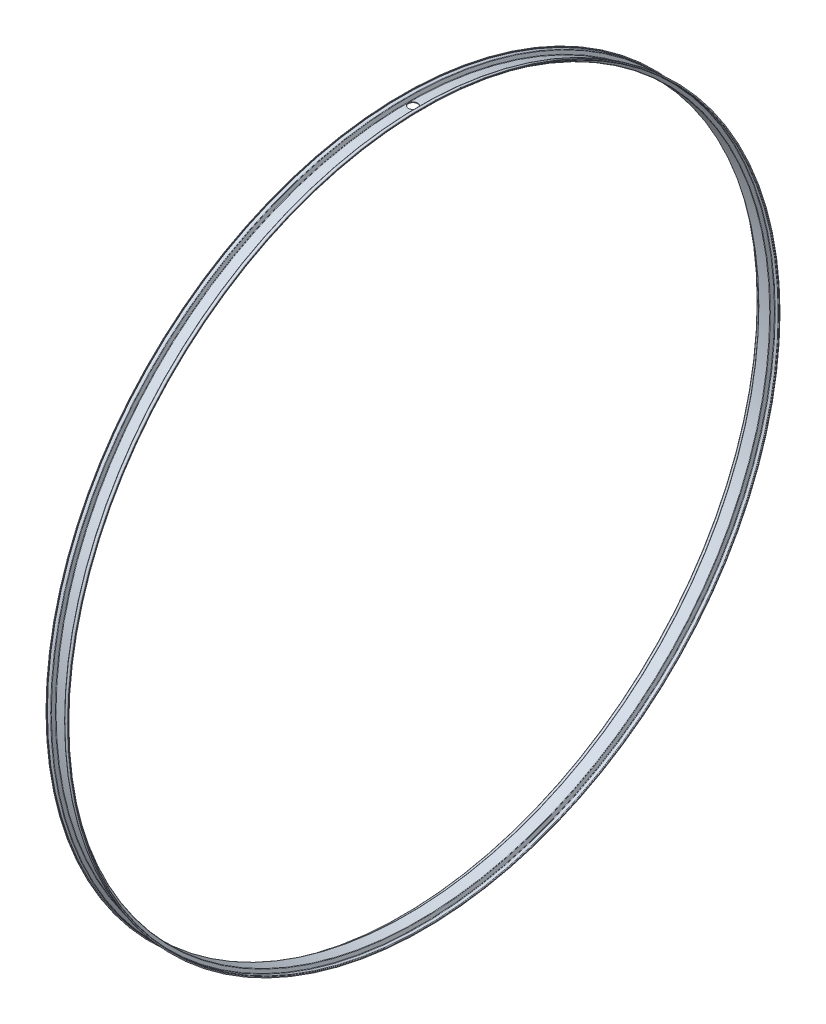
ISO-10303-21;
HEADER;
FILE_DESCRIPTION(('STEP AP214'),'2;1');
FILE_NAME('part.step','',(''),(''),'','','');
FILE_SCHEMA(('AUTOMOTIVE_DESIGN { 1 0 10303 214 1 1 1 1 }'));
ENDSEC;
DATA;
#1=APPLICATION_CONTEXT('core data for automotive mechanical design processes');
#2=APPLICATION_PROTOCOL_DEFINITION('international standard','automotive_design',2000,#1);
#3=PRODUCT_CONTEXT('',#1,'mechanical');
#4=PRODUCT('Part','Part','',(#3));
#5=PRODUCT_RELATED_PRODUCT_CATEGORY('part','',(#4));
#6=PRODUCT_DEFINITION_FORMATION('','',#4);
#7=PRODUCT_DEFINITION_CONTEXT('part definition',#1,'design');
#8=PRODUCT_DEFINITION('design','',#6,#7);
#9=PRODUCT_DEFINITION_SHAPE('','',#8);
#10=(LENGTH_UNIT() NAMED_UNIT(*) SI_UNIT(.MILLI.,.METRE.));
#11=(NAMED_UNIT(*) PLANE_ANGLE_UNIT() SI_UNIT($,.RADIAN.));
#12=(NAMED_UNIT(*) SI_UNIT($,.STERADIAN.) SOLID_ANGLE_UNIT());
#13=UNCERTAINTY_MEASURE_WITH_UNIT(LENGTH_MEASURE(1.E-05),#10,'distance_accuracy_value','');
#14=(GEOMETRIC_REPRESENTATION_CONTEXT(3) GLOBAL_UNCERTAINTY_ASSIGNED_CONTEXT((#13)) GLOBAL_UNIT_ASSIGNED_CONTEXT((#10,
#11,#12)) REPRESENTATION_CONTEXT('',''));
#15=CARTESIAN_POINT('',(0.,0.,0.));
#16=DIRECTION('',(0.,0.,1.));
#17=DIRECTION('',(1.,0.,0.));
#18=AXIS2_PLACEMENT_3D('',#15,#16,#17);
#19=CARTESIAN_POINT('',(-11.2328924162257,0.,0.));
#20=DIRECTION('',(-1.,0.,0.));
#21=DIRECTION('',(0.,0.,1.));
#22=AXIS2_PLACEMENT_3D('',#19,#20,#21);
#23=CYLINDRICAL_SURFACE('',#22,306.5);
#24=CARTESIAN_POINT('',(-4.66666666666666,0.,0.));
#25=DIRECTION('',(1.,0.,0.));
#26=DIRECTION('',(0.,0.,-1.));
#27=AXIS2_PLACEMENT_3D('',#24,#25,#26);
#28=CIRCLE('',#27,306.5);
#29=CARTESIAN_POINT('',(-4.66666666666666,0.,-306.5));
#30=VERTEX_POINT('',#29);
#31=EDGE_CURVE('E81',#30,#30,#28,.F.);
#32=ORIENTED_EDGE('',*,*,#31,.T.);
#33=EDGE_LOOP('',(#32));
#34=FACE_BOUND('',#33,.T.);
#35=CARTESIAN_POINT('',(4.66666666666666,0.,0.));
#36=DIRECTION('',(1.,0.,0.));
#37=DIRECTION('',(0.,0.,-1.));
#38=AXIS2_PLACEMENT_3D('',#35,#36,#37);
#39=CIRCLE('',#38,306.5);
#40=CARTESIAN_POINT('',(4.66666666666666,0.,-306.5));
#41=VERTEX_POINT('',#40);
#42=EDGE_CURVE('E78',#41,#41,#39,.T.);
#43=ORIENTED_EDGE('',*,*,#42,.T.);
#44=EDGE_LOOP('',(#43));
#45=FACE_BOUND('',#44,.T.);
#46=CARTESIAN_POINT('',(0.,306.473897746611,-4.00000000000001));
#47=CARTESIAN_POINT('',(0.224671491113787,306.473898099484,-3.99999004008703));
#48=CARTESIAN_POINT('',(0.449505646728402,306.474147454764,-3.98100750107468));
#49=CARTESIAN_POINT('',(0.892981203904015,306.475118203566,-3.90554619872519));
#50=CARTESIAN_POINT('',(1.11161483252134,306.475840164426,-3.84902236781322));
#51=CARTESIAN_POINT('',(1.53620035744824,306.477674325274,-3.70008849065035));
#52=CARTESIAN_POINT('',(1.74215828399459,306.478786337989,-3.60769566372456));
#53=CARTESIAN_POINT('',(2.13558191154165,306.481275060028,-3.38967033891498));
#54=CARTESIAN_POINT('',(2.32305217909934,306.482651703738,-3.26404607775796));
#55=CARTESIAN_POINT('',(2.67427542582028,306.485514911113,-2.98309061111759));
#56=CARTESIAN_POINT('',(2.83802465670473,306.487001492093,-2.82775471973071));
#57=CARTESIAN_POINT('',(3.13712709999816,306.489916865002,-2.49179051313609));
#58=CARTESIAN_POINT('',(3.27247919430501,306.491345654653,-2.311161202498));
#59=CARTESIAN_POINT('',(3.51093978329407,306.493984327251,-1.92973810948226));
#60=CARTESIAN_POINT('',(3.61404772876004,306.495194206469,-1.72894398371325));
#61=CARTESIAN_POINT('',(3.78508887690038,306.497258620251,-1.31289386383484));
#62=CARTESIAN_POINT('',(3.8530221635972,306.498113155664,-1.09763790427211));
#63=CARTESIAN_POINT('',(3.95178222468829,306.499370502746,-0.658787004672028));
#64=CARTESIAN_POINT('',(3.9826110711892,306.499773339639,-0.43519253102009));
#65=CARTESIAN_POINT('',(4.00629345607914,306.500081958505,0.013998449637373));
#66=CARTESIAN_POINT('',(3.9991470786256,306.499987741578,0.239594952205067));
#67=CARTESIAN_POINT('',(3.94708380428691,306.499312898516,0.686371977888896));
#68=CARTESIAN_POINT('',(3.90216919535925,306.498732301845,0.907552767673113));
#69=CARTESIAN_POINT('',(3.77584792945238,306.497150185938,1.33923450109525));
#70=CARTESIAN_POINT('',(3.69444122602987,306.496148666166,1.54973543114058));
#71=CARTESIAN_POINT('',(3.49744403063779,306.493837559996,1.95408911569046));
#72=CARTESIAN_POINT('',(3.38185249107094,306.492527964158,2.1479413597596));
#73=CARTESIAN_POINT('',(3.11976773545229,306.489748342096,2.5134891535125));
#74=CARTESIAN_POINT('',(2.97327451617181,306.488278315856,2.68518470088125));
#75=CARTESIAN_POINT('',(2.65353182924212,306.48534342464,3.00155868628569));
#76=CARTESIAN_POINT('',(2.48028036389358,306.483878560058,3.1462351053622));
#77=CARTESIAN_POINT('',(2.11194630000829,306.481119254487,3.4044483908349));
#78=CARTESIAN_POINT('',(1.91686369850563,306.479824813521,3.51798525300055));
#79=CARTESIAN_POINT('',(1.51040408351148,306.477552305354,3.71069620009634));
#80=CARTESIAN_POINT('',(1.29902704183232,306.476574238701,3.78987022558079));
#81=CARTESIAN_POINT('',(0.865979391617674,306.475044776151,3.91160671998754));
#82=CARTESIAN_POINT('',(0.644308788760933,306.474493380019,3.95416920910739));
#83=CARTESIAN_POINT('',(0.196984086633276,306.473879465282,4.001471952866));
#84=CARTESIAN_POINT('',(-0.0286697174887044,306.473816910606,4.00621499817331));
#85=CARTESIAN_POINT('',(-0.477570599960375,306.474187637362,3.9777514810267));
#86=CARTESIAN_POINT('',(-0.700817678749348,306.474620918705,3.94454492549959));
#87=CARTESIAN_POINT('',(-1.13856004689291,306.475934436635,3.84112714455738));
#88=CARTESIAN_POINT('',(-1.35305563463638,306.476814657971,3.77091718194009));
#89=CARTESIAN_POINT('',(-1.76721527682583,306.47892280651,3.5954869231225));
#90=CARTESIAN_POINT('',(-1.96687932718051,306.48015073381,3.49026661726462));
#91=CARTESIAN_POINT('',(-2.34572091198916,306.48281594592,3.24779535761251));
#92=CARTESIAN_POINT('',(-2.52489724413876,306.484253243006,3.11054252545252));
#93=CARTESIAN_POINT('',(-2.85766511754281,306.487175110404,2.80790511076166));
#94=CARTESIAN_POINT('',(-3.01125663806009,306.488659680754,2.64252050542947));
#95=CARTESIAN_POINT('',(-3.28850414599514,306.491508828741,2.28830235326852));
#96=CARTESIAN_POINT('',(-3.41215832759051,306.492873399135,2.09946739295163));
#97=CARTESIAN_POINT('',(-3.62600856025281,306.495328602469,1.70371638631362));
#98=CARTESIAN_POINT('',(-3.71620465424668,306.49641923576,1.49680036319104));
#99=CARTESIAN_POINT('',(-3.8605752908649,306.49820357454,1.07076768136215));
#100=CARTESIAN_POINT('',(-3.91475101566438,306.498897293055,0.851651423318843));
#101=CARTESIAN_POINT('',(-3.98554696940472,306.49980964543,0.40743227013172));
#102=CARTESIAN_POINT('',(-4.00216714969382,306.500028278673,0.182329367232824));
#103=CARTESIAN_POINT('',(-3.99737994522976,306.499965810826,-0.267454430431673));
#104=CARTESIAN_POINT('',(-3.97597545497528,306.499684747773,-0.492135356015586));
#105=CARTESIAN_POINT('',(-3.89575235748228,306.498654645373,-0.93471475755001));
#106=CARTESIAN_POINT('',(-3.83693367518455,306.497905605088,-1.15261321989283));
#107=CARTESIAN_POINT('',(-3.68355115042983,306.496023966824,-1.57544616137659));
#108=CARTESIAN_POINT('',(-3.58898664864653,306.494891361772,-1.78038040131298));
#109=CARTESIAN_POINT('',(-3.36680110670951,306.492370319351,-2.17145672875409));
#110=CARTESIAN_POINT('',(-3.23918134509481,306.490981891878,-2.35759954270238));
#111=CARTESIAN_POINT('',(-2.9545119739493,306.488105709753,-2.70581462853707));
#112=CARTESIAN_POINT('',(-2.79746325704137,306.486617958114,-2.86788763022857));
#113=CARTESIAN_POINT('',(-2.4583395638197,306.48371041295,-3.16340880646173));
#114=CARTESIAN_POINT('',(-2.27625838140577,306.482290636395,-3.29684986143866));
#115=CARTESIAN_POINT('',(-1.89219926591783,306.479678852065,-3.53132419016103));
#116=CARTESIAN_POINT('',(-1.69021124005617,306.478486960737,-3.63234091311074));
#117=CARTESIAN_POINT('',(-1.27229914448089,306.476467720134,-3.79891284555364));
#118=CARTESIAN_POINT('',(-1.05639211386792,306.475639934498,-3.86451052441714));
#119=CARTESIAN_POINT('',(-0.699259477652309,306.474664476077,-3.94091781558989));
#120=CARTESIAN_POINT('',(-0.560353981378442,306.474378193147,-3.96304594097856));
#121=CARTESIAN_POINT('',(-0.28098686881276,306.473994718063,-3.99259014759408));
#122=CARTESIAN_POINT('',(-0.140525252606067,306.473897525899,-4.00000622962568));
#123=CARTESIAN_POINT('',(0.,306.473897746611,-4.00000000000001));
#124=B_SPLINE_CURVE_WITH_KNOTS('',3,(#46,#47,#48,#49,#50,#51,#52,#53,#54,#55,#56,#57,#58,#59,
#60,#61,#62,#63,#64,#65,#66,#67,#68,#69,#70,#71,#72,#73,#74,#75,#76,#77,#78,#79,#80,#81,#82,#83,
#84,#85,#86,#87,#88,#89,#90,#91,#92,#93,#94,#95,#96,#97,#98,#99,#100,#101,#102,#103,#104,#105,
#106,#107,#108,#109,#110,#111,#112,#113,#114,#115,#116,#117,#118,#119,#120,#121,#122,#123),
.UNSPECIFIED.,.T.,.F.,(4,2,2,2,2,2,2,2,2,2,2,2,2,2,2,2,2,2,2,2,2,2,2,2,2,2,2,2,2,2,2,2,2,2,2,2,
2,2,4),(0.,0.673501553031845,1.34781309623774,2.02180132790529,2.69562266145693,
3.36955035299317,4.04350457462082,4.71747027511994,5.39143436569563,6.06536081683324,
6.73928577447353,7.41316990942957,8.08705490203669,8.76096054804817,9.43486626447107,
10.1088223172408,10.7827784615727,11.4567357718046,12.1306927102332,12.8045999174219,
13.4785070016048,14.1523910891679,14.8262753626219,15.5001991621289,16.1741235078664,
16.8480884946453,17.5220526167198,18.1959946184501,18.8699374932457,19.5438290686308,
20.217721995961,20.8916273537521,21.5655066495591,22.2393655089377,22.913391735076,
23.5877614685243,24.2613207899182,24.6825757545701,25.1038306961792),.UNSPECIFIED.);
#125=CARTESIAN_POINT('',(0.,306.473897746611,-4.00000000000001));
#126=VERTEX_POINT('',#125);
#127=EDGE_CURVE('E117',#126,#126,#124,.T.);
#128=ORIENTED_EDGE('',*,*,#127,.F.);
#129=EDGE_LOOP('',(#128));
#130=FACE_BOUND('',#129,.T.);
#131=ADVANCED_FACE('F27',(#34,#45,#130),#23,.F.);
#132=CARTESIAN_POINT('',(-11.2328924162257,0.,0.));
#133=DIRECTION('',(-1.,0.,0.));
#134=DIRECTION('',(0.,0.,1.));
#135=AXIS2_PLACEMENT_3D('',#132,#133,#134);
#136=CYLINDRICAL_SURFACE('',#135,307.);
#137=CARTESIAN_POINT('',(-4.33333333333332,0.,0.));
#138=DIRECTION('',(-1.,0.,0.));
#139=DIRECTION('',(0.,0.,1.));
#140=AXIS2_PLACEMENT_3D('',#137,#138,#139);
#141=CIRCLE('',#140,307.);
#142=CARTESIAN_POINT('',(-4.33333333333332,0.,307.));
#143=VERTEX_POINT('',#142);
#144=EDGE_CURVE('E39',#143,#143,#141,.F.);
#145=ORIENTED_EDGE('',*,*,#144,.T.);
#146=EDGE_LOOP('',(#145));
#147=FACE_BOUND('',#146,.T.);
#148=CARTESIAN_POINT('',(4.33333333333332,0.,0.));
#149=DIRECTION('',(-1.,0.,0.));
#150=DIRECTION('',(0.,0.,1.));
#151=AXIS2_PLACEMENT_3D('',#148,#149,#150);
#152=CIRCLE('',#151,307.);
#153=CARTESIAN_POINT('',(4.33333333333332,0.,307.));
#154=VERTEX_POINT('',#153);
#155=EDGE_CURVE('E10',#154,#154,#152,.T.);
#156=ORIENTED_EDGE('',*,*,#155,.T.);
#157=EDGE_LOOP('',(#156));
#158=FACE_BOUND('',#157,.T.);
#159=CARTESIAN_POINT('',(0.,306.973940262036,-4.00000000000006));
#160=CARTESIAN_POINT('',(-0.224671524523298,306.973940614335,-3.99999004007576));
#161=CARTESIAN_POINT('',(-0.449505714364031,306.974189563503,-3.98100749543986));
#162=CARTESIAN_POINT('',(-0.892981341340778,306.975158731319,-3.9055461694517));
#163=CARTESIAN_POINT('',(-1.11161500549672,306.975879516384,-3.84902232029855));
#164=CARTESIAN_POINT('',(-1.53620060168189,306.977710690143,-3.70008839183099));
#165=CARTESIAN_POINT('',(-1.74215856385908,306.978820891872,-3.60769553159317));
#166=CARTESIAN_POINT('',(-2.13558225559796,306.981305560897,-3.38967012528727));
#167=CARTESIAN_POINT('',(-2.32305255176983,306.982679962685,-3.26404581604283));
#168=CARTESIAN_POINT('',(-2.67427581239524,306.985538506937,-2.98309026548255));
#169=CARTESIAN_POINT('',(-2.83802503268025,306.987022666669,-2.82775434340226));
#170=CARTESIAN_POINT('',(-3.13712744710857,306.989933291128,-2.49179007726189));
#171=CARTESIAN_POINT('',(-3.27247952315907,306.991359753581,-2.31116073778007));
#172=CARTESIAN_POINT('',(-3.51094005356269,306.993994128052,-1.92973761588895));
#173=CARTESIAN_POINT('',(-3.61404796244238,306.995202036372,-1.72894349242863));
#174=CARTESIAN_POINT('',(-3.78508904020217,306.997263087096,-1.31289338947289));
#175=CARTESIAN_POINT('',(-3.85302229306144,306.998116230347,-1.09763744450633));
#176=CARTESIAN_POINT('',(-3.95178230257386,306.999371528991,-0.658786543063262));
#177=CARTESIAN_POINT('',(-3.98261112436006,306.999773709484,-0.435192051402092));
#178=CARTESIAN_POINT('',(-4.00629345509424,307.00008182501,0.0139989598463144));
#179=CARTESIAN_POINT('',(-3.99914704814848,306.999987761143,0.239595474998432));
#180=CARTESIAN_POINT('',(-3.94708370517001,306.999314016298,0.686372567212298));
#181=CARTESIAN_POINT('',(-3.90216904960303,306.998734364641,0.907553410069089));
#182=CARTESIAN_POINT('',(-3.77584767048059,306.997154824171,1.33923524178861));
#183=CARTESIAN_POINT('',(-3.69444090050756,306.996154934825,1.54973621706628));
#184=CARTESIAN_POINT('',(-3.4974435626224,306.993847591384,1.95408995856477));
#185=CARTESIAN_POINT('',(-3.38185195055622,306.992540127895,2.14794221602776));
#186=CARTESIAN_POINT('',(-3.11976704012206,306.989765032055,2.51349002096246));
#187=CARTESIAN_POINT('',(-2.97327373857661,306.988297399687,2.68518556615589));
#188=CARTESIAN_POINT('',(-2.65353092204143,306.985367288545,3.00155948804889));
#189=CARTESIAN_POINT('',(-2.48027941584223,306.983904810162,3.14623585234699));
#190=CARTESIAN_POINT('',(-2.11194528348035,306.981149999752,3.40444902107899));
#191=CARTESIAN_POINT('',(-1.91686265435214,306.979857667749,3.51798582128289));
#192=CARTESIAN_POINT('',(-1.51040300181046,306.977588862447,3.71069663972548));
#193=CARTESIAN_POINT('',(-1.29902595030502,306.976612389693,3.78987059872022));
#194=CARTESIAN_POINT('',(-0.865978296875617,306.975085420046,3.91160696144251));
#195=CARTESIAN_POINT('',(-0.644307700613396,306.974534922919,3.9541693853072));
#196=CARTESIAN_POINT('',(-0.196982970959951,306.973922009741,4.00147200971533));
#197=CARTESIAN_POINT('',(0.0286708682438425,306.973859557794,4.0062149918448));
#198=CARTESIAN_POINT('',(0.477571810429255,306.974229682434,3.97775133763645));
#199=CARTESIAN_POINT('',(0.700818913848376,306.974662258932,3.94454470819732));
#200=CARTESIAN_POINT('',(1.13856134529725,306.975973639217,3.84112676331502));
#201=CARTESIAN_POINT('',(1.35305697074308,306.976852427827,3.77091670655149));
#202=CARTESIAN_POINT('',(1.76721667137197,306.978957144545,3.59548624185708));
#203=CARTESIAN_POINT('',(1.96688074248337,306.980183072747,3.4902658243149));
#204=CARTESIAN_POINT('',(2.34572230931802,306.982843945229,3.24779435037668));
#205=CARTESIAN_POINT('',(2.52489860665704,306.984278901724,3.11054142174061));
#206=CARTESIAN_POINT('',(2.85766639126619,306.987196010588,2.80790381692908));
#207=CARTESIAN_POINT('',(3.01125785783293,306.988678162995,2.64251911798946));
#208=CARTESIAN_POINT('',(3.28850520989275,306.991522669819,2.28830082302399));
#209=CARTESIAN_POINT('',(3.41215929541036,306.99288501703,2.09946581808818));
#210=CARTESIAN_POINT('',(3.62600933051267,306.995336219847,1.70371474468728));
#211=CARTESIAN_POINT('',(3.7162053229996,306.996425075805,1.49679869940732));
#212=CARTESIAN_POINT('',(3.86057576442476,306.998206506303,1.07076597422887));
#213=CARTESIAN_POINT('',(3.91475139173827,306.998899093807,0.851649693704759));
#214=CARTESIAN_POINT('',(3.98554714865052,306.999809957791,0.407430515309249));
#215=CARTESIAN_POINT('',(4.0021672295356,307.000028233656,0.182327609672926));
#216=CARTESIAN_POINT('',(3.9973798275177,306.999965864974,-0.267456231610213));
#217=CARTESIAN_POINT('',(3.97597522992876,306.999685258283,-0.492137197978779));
#218=CARTESIAN_POINT('',(3.89575190313022,306.998656830733,-0.934716663726365));
#219=CARTESIAN_POINT('',(3.83693309886077,306.997909008937,-1.15261514949755));
#220=CARTESIAN_POINT('',(3.68355031695002,306.996030432495,-1.57544811819663));
#221=CARTESIAN_POINT('',(3.58898567995627,306.994899670784,-1.78038236191022));
#222=CARTESIAN_POINT('',(3.36679985754237,306.992382732091,-2.17145867189447));
#223=CARTESIAN_POINT('',(3.23917995072487,306.99099656499,-2.35760146464559));
#224=CARTESIAN_POINT('',(2.95451031984494,306.988125066329,-2.70581643556063));
#225=CARTESIAN_POINT('',(2.79746149552175,306.986639737802,-2.86788934934882));
#226=CARTESIAN_POINT('',(2.45833760356065,306.983736928865,-3.1634103305783));
#227=CARTESIAN_POINT('',(2.27625632981208,306.982319465399,-3.29685127843344));
#228=CARTESIAN_POINT('',(1.89219707460493,306.979711937032,-3.53132536336945));
#229=CARTESIAN_POINT('',(1.6902090024449,306.978521988367,-3.63234195304775));
#230=CARTESIAN_POINT('',(1.27229684422677,306.976506039698,-3.79891361466021));
#231=CARTESIAN_POINT('',(1.05638979729004,306.975679604043,-3.86451115610832));
#232=CARTESIAN_POINT('',(0.699257527298371,306.97470573827,-3.94091814758694));
#233=CARTESIAN_POINT('',(0.560352412695073,306.974419923267,-3.96304614877196));
#234=CARTESIAN_POINT('',(0.280986077451796,306.974037074979,-3.9925901893846));
#235=CARTESIAN_POINT('',(0.140524856896659,306.973940041684,-4.00000622961434));
#236=CARTESIAN_POINT('',(0.,306.973940262036,-4.00000000000006));
#237=B_SPLINE_CURVE_WITH_KNOTS('',3,(#159,#160,#161,#162,#163,#164,#165,#166,#167,#168,#169,
#170,#171,#172,#173,#174,#175,#176,#177,#178,#179,#180,#181,#182,#183,#184,#185,#186,#187,#188,
#189,#190,#191,#192,#193,#194,#195,#196,#197,#198,#199,#200,#201,#202,#203,#204,#205,#206,#207,
#208,#209,#210,#211,#212,#213,#214,#215,#216,#217,#218,#219,#220,#221,#222,#223,#224,#225,#226,
#227,#228,#229,#230,#231,#232,#233,#234,#235,#236),.UNSPECIFIED.,.T.,.F.,(4,2,2,2,2,2,2,2,2,2,2,
2,2,2,2,2,2,2,2,2,2,2,2,2,2,2,2,2,2,2,2,2,2,2,2,2,2,2,4),(0.,0.673501654716201,1.34781330352654,
2.02180164554422,2.69562308753221,3.36955077084389,4.0435049840187,4.71747059783636,
5.39143460255975,6.06536109452025,6.73928609389159,7.41317040425624,8.08705557179668,
8.76096132485307,9.43486714720398,10.1088231423819,10.7827792291099,11.4567364777804,
12.1306933557594,12.804600664357,13.478507850448,14.1523921149187,14.826276564389,
15.5002004110064,16.174124802964,16.8480897043535,17.5220537415369,18.1959957294815,
18.8699385916024,19.5438303170976,20.217723394549,20.8916289029528,21.5655083480778,
22.2393671938419,22.9133934067534,23.5877630563801,24.261322291405,24.6825760707149,
25.1038298270575),.UNSPECIFIED.);
#238=CARTESIAN_POINT('',(0.,306.973940262036,-4.00000000000006));
#239=VERTEX_POINT('',#238);
#240=EDGE_CURVE('E31',#239,#239,#237,.T.);
#241=ORIENTED_EDGE('',*,*,#240,.F.);
#242=EDGE_LOOP('',(#241));
#243=FACE_BOUND('',#242,.T.);
#244=ADVANCED_FACE('F187',(#147,#158,#243),#136,.T.);
#245=CARTESIAN_POINT('',(-9.5,309.5,0.));
#246=DIRECTION('',(1.,0.,0.));
#247=DIRECTION('',(0.,0.,-1.));
#248=AXIS2_PLACEMENT_3D('',#245,#246,#247);
#249=PLANE('',#248);
#250=CARTESIAN_POINT('',(-9.5,0.,0.));
#251=DIRECTION('',(1.,0.,0.));
#252=DIRECTION('',(0.,0.,-1.));
#253=AXIS2_PLACEMENT_3D('',#250,#251,#252);
#254=CIRCLE('',#253,310.);
#255=CARTESIAN_POINT('',(-9.5,0.,-310.));
#256=VERTEX_POINT('',#255);
#257=EDGE_CURVE('E54',#256,#256,#254,.T.);
#258=ORIENTED_EDGE('',*,*,#257,.T.);
#259=EDGE_LOOP('',(#258));
#260=FACE_BOUND('',#259,.T.);
#261=CARTESIAN_POINT('',(-9.5,0.,0.));
#262=DIRECTION('',(-1.,0.,0.));
#263=DIRECTION('',(0.,0.,1.));
#264=AXIS2_PLACEMENT_3D('',#261,#262,#263);
#265=CIRCLE('',#264,310.7);
#266=CARTESIAN_POINT('',(-9.5,0.,310.7));
#267=VERTEX_POINT('',#266);
#268=EDGE_CURVE('E114',#267,#267,#265,.T.);
#269=ORIENTED_EDGE('',*,*,#268,.T.);
#270=EDGE_LOOP('',(#269));
#271=FACE_BOUND('',#270,.T.);
#272=ADVANCED_FACE('F29',(#260,#271),#249,.F.);
#273=CARTESIAN_POINT('',(-11.2328924162257,0.,0.));
#274=DIRECTION('',(-1.,0.,0.));
#275=DIRECTION('',(0.,0.,1.));
#276=AXIS2_PLACEMENT_3D('',#273,#274,#275);
#277=CYLINDRICAL_SURFACE('',#276,309.5);
#278=CARTESIAN_POINT('',(-6.58333333333334,0.,0.));
#279=DIRECTION('',(-1.,0.,0.));
#280=DIRECTION('',(0.,0.,1.));
#281=AXIS2_PLACEMENT_3D('',#278,#279,#280);
#282=CIRCLE('',#281,309.5);
#283=CARTESIAN_POINT('',(-6.58333333333334,0.,309.5));
#284=VERTEX_POINT('',#283);
#285=EDGE_CURVE('E60',#284,#284,#282,.F.);
#286=ORIENTED_EDGE('',*,*,#285,.T.);
#287=EDGE_LOOP('',(#286));
#288=FACE_BOUND('',#287,.T.);
#289=CARTESIAN_POINT('',(-9.,0.,0.));
#290=DIRECTION('',(1.,0.,0.));
#291=DIRECTION('',(0.,0.,-1.));
#292=AXIS2_PLACEMENT_3D('',#289,#290,#291);
#293=CIRCLE('',#292,309.5);
#294=CARTESIAN_POINT('',(-9.,0.,-309.5));
#295=VERTEX_POINT('',#294);
#296=EDGE_CURVE('E63',#295,#295,#293,.F.);
#297=ORIENTED_EDGE('',*,*,#296,.T.);
#298=EDGE_LOOP('',(#297));
#299=FACE_BOUND('',#298,.T.);
#300=ADVANCED_FACE('F221',(#288,#299),#277,.F.);
#301=CARTESIAN_POINT('',(-6.25,0.,0.));
#302=DIRECTION('',(-1.,0.,0.));
#303=DIRECTION('',(0.,0.,1.));
#304=AXIS2_PLACEMENT_3D('',#301,#302,#303);
#305=CONICAL_SURFACE('',#304,309.5,1.17600520709514);
#306=CARTESIAN_POINT('',(-6.12179487179487,0.,0.));
#307=DIRECTION('',(-1.,0.,0.));
#308=DIRECTION('',(0.,0.,1.));
#309=AXIS2_PLACEMENT_3D('',#306,#307,#308);
#310=CIRCLE('',#309,309.192307692308);
#311=CARTESIAN_POINT('',(-6.12179487179487,0.,309.192307692308));
#312=VERTEX_POINT('',#311);
#313=EDGE_CURVE('E66',#312,#312,#310,.T.);
#314=ORIENTED_EDGE('',*,*,#313,.T.);
#315=EDGE_LOOP('',(#314));
#316=FACE_BOUND('',#315,.T.);
#317=CARTESIAN_POINT('',(-5.12820512820514,0.,0.));
#318=DIRECTION('',(1.,0.,0.));
#319=DIRECTION('',(0.,0.,-1.));
#320=AXIS2_PLACEMENT_3D('',#317,#318,#319);
#321=CIRCLE('',#320,306.807692307692);
#322=CARTESIAN_POINT('',(-5.12820512820514,0.,-306.807692307692));
#323=VERTEX_POINT('',#322);
#324=EDGE_CURVE('E69',#323,#323,#321,.T.);
#325=ORIENTED_EDGE('',*,*,#324,.T.);
#326=EDGE_LOOP('',(#325));
#327=FACE_BOUND('',#326,.T.);
#328=ADVANCED_FACE('F216',(#316,#327),#305,.F.);
#329=CARTESIAN_POINT('',(5.,0.,0.));
#330=DIRECTION('',(1.,0.,0.));
#331=DIRECTION('',(0.,0.,-1.));
#332=AXIS2_PLACEMENT_3D('',#329,#330,#331);
#333=CONICAL_SURFACE('',#332,306.5,1.17600520709514);
#334=CARTESIAN_POINT('',(5.12820512820514,0.,0.));
#335=DIRECTION('',(-1.,0.,0.));
#336=DIRECTION('',(0.,0.,1.));
#337=AXIS2_PLACEMENT_3D('',#334,#335,#336);
#338=CIRCLE('',#337,306.807692307692);
#339=CARTESIAN_POINT('',(5.12820512820514,0.,306.807692307692));
#340=VERTEX_POINT('',#339);
#341=EDGE_CURVE('E84',#340,#340,#338,.T.);
#342=ORIENTED_EDGE('',*,*,#341,.T.);
#343=EDGE_LOOP('',(#342));
#344=FACE_BOUND('',#343,.T.);
#345=CARTESIAN_POINT('',(6.12179487179487,0.,0.));
#346=DIRECTION('',(1.,0.,0.));
#347=DIRECTION('',(0.,0.,-1.));
#348=AXIS2_PLACEMENT_3D('',#345,#346,#347);
#349=CIRCLE('',#348,309.192307692308);
#350=CARTESIAN_POINT('',(6.12179487179487,0.,-309.192307692308));
#351=VERTEX_POINT('',#350);
#352=EDGE_CURVE('E87',#351,#351,#349,.T.);
#353=ORIENTED_EDGE('',*,*,#352,.T.);
#354=EDGE_LOOP('',(#353));
#355=FACE_BOUND('',#354,.T.);
#356=ADVANCED_FACE('F213',(#344,#355),#333,.F.);
#357=CARTESIAN_POINT('',(-11.2328924162257,0.,0.));
#358=DIRECTION('',(-1.,0.,0.));
#359=DIRECTION('',(0.,0.,1.));
#360=AXIS2_PLACEMENT_3D('',#357,#358,#359);
#361=CYLINDRICAL_SURFACE('',#360,309.5);
#362=CARTESIAN_POINT('',(6.58333333333334,0.,0.));
#363=DIRECTION('',(-1.,0.,0.));
#364=DIRECTION('',(0.,0.,1.));
#365=AXIS2_PLACEMENT_3D('',#362,#363,#364);
#366=CIRCLE('',#365,309.5);
#367=CARTESIAN_POINT('',(6.58333333333334,0.,309.5));
#368=VERTEX_POINT('',#367);
#369=EDGE_CURVE('E72',#368,#368,#366,.T.);
#370=ORIENTED_EDGE('',*,*,#369,.T.);
#371=EDGE_LOOP('',(#370));
#372=FACE_BOUND('',#371,.T.);
#373=CARTESIAN_POINT('',(9.,0.,0.));
#374=DIRECTION('',(-1.,0.,0.));
#375=DIRECTION('',(0.,0.,1.));
#376=AXIS2_PLACEMENT_3D('',#373,#374,#375);
#377=CIRCLE('',#376,309.5);
#378=CARTESIAN_POINT('',(9.,0.,309.5));
#379=VERTEX_POINT('',#378);
#380=EDGE_CURVE('E75',#379,#379,#377,.F.);
#381=ORIENTED_EDGE('',*,*,#380,.T.);
#382=EDGE_LOOP('',(#381));
#383=FACE_BOUND('',#382,.T.);
#384=ADVANCED_FACE('F210',(#372,#383),#361,.F.);
#385=CARTESIAN_POINT('',(9.5,309.5,0.));
#386=DIRECTION('',(-1.,0.,0.));
#387=DIRECTION('',(0.,0.,1.));
#388=AXIS2_PLACEMENT_3D('',#385,#386,#387);
#389=PLANE('',#388);
#390=CARTESIAN_POINT('',(9.5,0.,0.));
#391=DIRECTION('',(-1.,0.,0.));
#392=DIRECTION('',(0.,0.,1.));
#393=AXIS2_PLACEMENT_3D('',#390,#391,#392);
#394=CIRCLE('',#393,310.);
#395=CARTESIAN_POINT('',(9.5,0.,310.));
#396=VERTEX_POINT('',#395);
#397=EDGE_CURVE('E57',#396,#396,#394,.T.);
#398=ORIENTED_EDGE('',*,*,#397,.T.);
#399=EDGE_LOOP('',(#398));
#400=FACE_BOUND('',#399,.T.);
#401=CARTESIAN_POINT('',(9.5,0.,0.));
#402=DIRECTION('',(-1.,0.,0.));
#403=DIRECTION('',(0.,0.,1.));
#404=AXIS2_PLACEMENT_3D('',#401,#402,#403);
#405=CIRCLE('',#404,310.7);
#406=CARTESIAN_POINT('',(9.5,0.,310.7));
#407=VERTEX_POINT('',#406);
#408=EDGE_CURVE('E99',#407,#407,#405,.T.);
#409=ORIENTED_EDGE('',*,*,#408,.F.);
#410=EDGE_LOOP('',(#409));
#411=FACE_BOUND('',#410,.T.);
#412=ADVANCED_FACE('F206',(#400,#411),#389,.F.);
#413=CARTESIAN_POINT('',(-11.2328924162257,0.,0.));
#414=DIRECTION('',(-1.,0.,0.));
#415=DIRECTION('',(0.,0.,1.));
#416=AXIS2_PLACEMENT_3D('',#413,#414,#415);
#417=CYLINDRICAL_SURFACE('',#416,310.7);
#418=CARTESIAN_POINT('',(9.,0.,0.));
#419=DIRECTION('',(-1.,0.,0.));
#420=DIRECTION('',(0.,0.,1.));
#421=AXIS2_PLACEMENT_3D('',#418,#419,#420);
#422=CIRCLE('',#421,310.7);
#423=CARTESIAN_POINT('',(9.,0.,310.7));
#424=VERTEX_POINT('',#423);
#425=EDGE_CURVE('E102',#424,#424,#422,.T.);
#426=ORIENTED_EDGE('',*,*,#425,.F.);
#427=EDGE_LOOP('',(#426));
#428=FACE_BOUND('',#427,.T.);
#429=ORIENTED_EDGE('',*,*,#408,.T.);
#430=EDGE_LOOP('',(#429));
#431=FACE_BOUND('',#430,.T.);
#432=ADVANCED_FACE('F202',(#428,#431),#417,.T.);
#433=CARTESIAN_POINT('',(9.,310.,0.));
#434=DIRECTION('',(1.,0.,0.));
#435=DIRECTION('',(0.,0.,-1.));
#436=AXIS2_PLACEMENT_3D('',#433,#434,#435);
#437=PLANE('',#436);
#438=CARTESIAN_POINT('',(9.,0.,0.));
#439=DIRECTION('',(-1.,0.,0.));
#440=DIRECTION('',(0.,0.,1.));
#441=AXIS2_PLACEMENT_3D('',#438,#439,#440);
#442=CIRCLE('',#441,310.);
#443=CARTESIAN_POINT('',(9.,0.,310.));
#444=VERTEX_POINT('',#443);
#445=EDGE_CURVE('E105',#444,#444,#442,.T.);
#446=ORIENTED_EDGE('',*,*,#445,.F.);
#447=EDGE_LOOP('',(#446));
#448=FACE_BOUND('',#447,.T.);
#449=ORIENTED_EDGE('',*,*,#425,.T.);
#450=EDGE_LOOP('',(#449));
#451=FACE_BOUND('',#450,.T.);
#452=ADVANCED_FACE('F198',(#448,#451),#437,.F.);
#453=CARTESIAN_POINT('',(-11.2328924162257,0.,0.));
#454=DIRECTION('',(-1.,0.,0.));
#455=DIRECTION('',(0.,0.,1.));
#456=AXIS2_PLACEMENT_3D('',#453,#454,#455);
#457=CYLINDRICAL_SURFACE('',#456,310.);
#458=CARTESIAN_POINT('',(6.25000000000001,0.,0.));
#459=DIRECTION('',(1.,0.,0.));
#460=DIRECTION('',(0.,0.,-1.));
#461=AXIS2_PLACEMENT_3D('',#458,#459,#460);
#462=CIRCLE('',#461,310.);
#463=CARTESIAN_POINT('',(6.25000000000001,0.,-310.));
#464=VERTEX_POINT('',#463);
#465=EDGE_CURVE('E43',#464,#464,#462,.T.);
#466=ORIENTED_EDGE('',*,*,#465,.T.);
#467=EDGE_LOOP('',(#466));
#468=FACE_BOUND('',#467,.T.);
#469=ORIENTED_EDGE('',*,*,#445,.T.);
#470=EDGE_LOOP('',(#469));
#471=FACE_BOUND('',#470,.T.);
#472=ADVANCED_FACE('F194',(#468,#471),#457,.T.);
#473=CARTESIAN_POINT('',(5.91666666666666,0.,0.));
#474=DIRECTION('',(1.,0.,0.));
#475=DIRECTION('',(0.,0.,-1.));
#476=AXIS2_PLACEMENT_3D('',#473,#474,#475);
#477=CONICAL_SURFACE('',#476,310.,1.17600520709514);
#478=CARTESIAN_POINT('',(5.78846153846153,0.,0.));
#479=DIRECTION('',(-1.,0.,0.));
#480=DIRECTION('',(0.,0.,1.));
#481=AXIS2_PLACEMENT_3D('',#478,#479,#480);
#482=CIRCLE('',#481,309.692307692308);
#483=CARTESIAN_POINT('',(5.78846153846153,0.,309.692307692308));
#484=VERTEX_POINT('',#483);
#485=EDGE_CURVE('E48',#484,#484,#482,.T.);
#486=ORIENTED_EDGE('',*,*,#485,.T.);
#487=EDGE_LOOP('',(#486));
#488=FACE_BOUND('',#487,.T.);
#489=CARTESIAN_POINT('',(4.7948717948717,0.,0.));
#490=DIRECTION('',(1.,0.,0.));
#491=DIRECTION('',(0.,0.,-1.));
#492=AXIS2_PLACEMENT_3D('',#489,#490,#491);
#493=CIRCLE('',#492,307.307692307692);
#494=CARTESIAN_POINT('',(4.7948717948717,0.,-307.307692307692));
#495=VERTEX_POINT('',#494);
#496=EDGE_CURVE('E51',#495,#495,#493,.T.);
#497=ORIENTED_EDGE('',*,*,#496,.T.);
#498=EDGE_LOOP('',(#497));
#499=FACE_BOUND('',#498,.T.);
#500=ADVANCED_FACE('F185',(#488,#499),#477,.T.);
#501=CARTESIAN_POINT('',(-4.66666666666666,0.,0.));
#502=DIRECTION('',(-1.,0.,0.));
#503=DIRECTION('',(0.,0.,1.));
#504=AXIS2_PLACEMENT_3D('',#501,#502,#503);
#505=CONICAL_SURFACE('',#504,307.,1.17600520709514);
#506=CARTESIAN_POINT('',(-5.78846153846152,0.,0.));
#507=DIRECTION('',(1.,0.,0.));
#508=DIRECTION('',(0.,0.,-1.));
#509=AXIS2_PLACEMENT_3D('',#506,#507,#508);
#510=CIRCLE('',#509,309.692307692308);
#511=CARTESIAN_POINT('',(-5.78846153846152,0.,-309.692307692308));
#512=VERTEX_POINT('',#511);
#513=EDGE_CURVE('E90',#512,#512,#510,.T.);
#514=ORIENTED_EDGE('',*,*,#513,.T.);
#515=EDGE_LOOP('',(#514));
#516=FACE_BOUND('',#515,.T.);
#517=CARTESIAN_POINT('',(-4.7948717948717,0.,0.));
#518=DIRECTION('',(-1.,0.,0.));
#519=DIRECTION('',(0.,0.,1.));
#520=AXIS2_PLACEMENT_3D('',#517,#518,#519);
#521=CIRCLE('',#520,307.307692307692);
#522=CARTESIAN_POINT('',(-4.7948717948717,0.,307.307692307692));
#523=VERTEX_POINT('',#522);
#524=EDGE_CURVE('E93',#523,#523,#521,.T.);
#525=ORIENTED_EDGE('',*,*,#524,.T.);
#526=EDGE_LOOP('',(#525));
#527=FACE_BOUND('',#526,.T.);
#528=ADVANCED_FACE('F182',(#516,#527),#505,.T.);
#529=CARTESIAN_POINT('',(-11.2328924162257,0.,0.));
#530=DIRECTION('',(-1.,0.,0.));
#531=DIRECTION('',(0.,0.,1.));
#532=AXIS2_PLACEMENT_3D('',#529,#530,#531);
#533=CYLINDRICAL_SURFACE('',#532,310.);
#534=CARTESIAN_POINT('',(-6.25,0.,0.));
#535=DIRECTION('',(1.,0.,0.));
#536=DIRECTION('',(0.,0.,-1.));
#537=AXIS2_PLACEMENT_3D('',#534,#535,#536);
#538=CIRCLE('',#537,310.);
#539=CARTESIAN_POINT('',(-6.25,0.,-310.));
#540=VERTEX_POINT('',#539);
#541=EDGE_CURVE('E96',#540,#540,#538,.F.);
#542=ORIENTED_EDGE('',*,*,#541,.T.);
#543=EDGE_LOOP('',(#542));
#544=FACE_BOUND('',#543,.T.);
#545=CARTESIAN_POINT('',(-9.,0.,0.));
#546=DIRECTION('',(-1.,0.,0.));
#547=DIRECTION('',(0.,0.,1.));
#548=AXIS2_PLACEMENT_3D('',#545,#546,#547);
#549=CIRCLE('',#548,310.);
#550=CARTESIAN_POINT('',(-9.,0.,310.));
#551=VERTEX_POINT('',#550);
#552=EDGE_CURVE('E108',#551,#551,#549,.T.);
#553=ORIENTED_EDGE('',*,*,#552,.F.);
#554=EDGE_LOOP('',(#553));
#555=FACE_BOUND('',#554,.T.);
#556=ADVANCED_FACE('F178',(#544,#555),#533,.T.);
#557=CARTESIAN_POINT('',(-9.,310.,0.));
#558=DIRECTION('',(-1.,0.,0.));
#559=DIRECTION('',(0.,0.,1.));
#560=AXIS2_PLACEMENT_3D('',#557,#558,#559);
#561=PLANE('',#560);
#562=CARTESIAN_POINT('',(-9.,0.,0.));
#563=DIRECTION('',(-1.,0.,0.));
#564=DIRECTION('',(0.,0.,1.));
#565=AXIS2_PLACEMENT_3D('',#562,#563,#564);
#566=CIRCLE('',#565,310.7);
#567=CARTESIAN_POINT('',(-9.,0.,310.7));
#568=VERTEX_POINT('',#567);
#569=EDGE_CURVE('E111',#568,#568,#566,.T.);
#570=ORIENTED_EDGE('',*,*,#569,.F.);
#571=EDGE_LOOP('',(#570));
#572=FACE_BOUND('',#571,.T.);
#573=ORIENTED_EDGE('',*,*,#552,.T.);
#574=EDGE_LOOP('',(#573));
#575=FACE_BOUND('',#574,.T.);
#576=ADVANCED_FACE('F174',(#572,#575),#561,.F.);
#577=CARTESIAN_POINT('',(-11.2328924162257,0.,0.));
#578=DIRECTION('',(-1.,0.,0.));
#579=DIRECTION('',(0.,0.,1.));
#580=AXIS2_PLACEMENT_3D('',#577,#578,#579);
#581=CYLINDRICAL_SURFACE('',#580,310.7);
#582=ORIENTED_EDGE('',*,*,#268,.F.);
#583=EDGE_LOOP('',(#582));
#584=FACE_BOUND('',#583,.T.);
#585=ORIENTED_EDGE('',*,*,#569,.T.);
#586=EDGE_LOOP('',(#585));
#587=FACE_BOUND('',#586,.T.);
#588=ADVANCED_FACE('F170',(#584,#587),#581,.T.);
#589=CARTESIAN_POINT('',(-6.25,0.,0.));
#590=DIRECTION('',(1.,0.,0.));
#591=DIRECTION('',(0.,0.,-1.));
#592=AXIS2_PLACEMENT_3D('',#589,#590,#591);
#593=TOROIDAL_SURFACE('',#592,309.5,0.5);
#594=ORIENTED_EDGE('',*,*,#513,.F.);
#595=EDGE_LOOP('',(#594));
#596=FACE_BOUND('',#595,.T.);
#597=ORIENTED_EDGE('',*,*,#541,.F.);
#598=EDGE_LOOP('',(#597));
#599=FACE_BOUND('',#598,.T.);
#600=ADVANCED_FACE('F166',(#596,#599),#593,.T.);
#601=CARTESIAN_POINT('',(4.66666666666666,0.,0.));
#602=DIRECTION('',(1.,0.,0.));
#603=DIRECTION('',(0.,0.,-1.));
#604=AXIS2_PLACEMENT_3D('',#601,#602,#603);
#605=TOROIDAL_SURFACE('',#604,307.,0.5);
#606=ORIENTED_EDGE('',*,*,#42,.F.);
#607=EDGE_LOOP('',(#606));
#608=FACE_BOUND('',#607,.T.);
#609=ORIENTED_EDGE('',*,*,#341,.F.);
#610=EDGE_LOOP('',(#609));
#611=FACE_BOUND('',#610,.T.);
#612=ADVANCED_FACE('F162',(#608,#611),#605,.T.);
#613=CARTESIAN_POINT('',(6.58333333333334,0.,0.));
#614=DIRECTION('',(-1.,0.,0.));
#615=DIRECTION('',(0.,0.,1.));
#616=AXIS2_PLACEMENT_3D('',#613,#614,#615);
#617=TOROIDAL_SURFACE('',#616,309.,0.5);
#618=ORIENTED_EDGE('',*,*,#352,.F.);
#619=EDGE_LOOP('',(#618));
#620=FACE_BOUND('',#619,.T.);
#621=ORIENTED_EDGE('',*,*,#369,.F.);
#622=EDGE_LOOP('',(#621));
#623=FACE_BOUND('',#622,.T.);
#624=ADVANCED_FACE('F158',(#620,#623),#617,.F.);
#625=CARTESIAN_POINT('',(-6.58333333333334,0.,0.));
#626=DIRECTION('',(-1.,0.,0.));
#627=DIRECTION('',(0.,0.,1.));
#628=AXIS2_PLACEMENT_3D('',#625,#626,#627);
#629=TOROIDAL_SURFACE('',#628,309.,0.5);
#630=ORIENTED_EDGE('',*,*,#285,.F.);
#631=EDGE_LOOP('',(#630));
#632=FACE_BOUND('',#631,.T.);
#633=ORIENTED_EDGE('',*,*,#313,.F.);
#634=EDGE_LOOP('',(#633));
#635=FACE_BOUND('',#634,.T.);
#636=ADVANCED_FACE('F154',(#632,#635),#629,.F.);
#637=CARTESIAN_POINT('',(-4.66666666666666,0.,0.));
#638=DIRECTION('',(1.,0.,0.));
#639=DIRECTION('',(0.,0.,-1.));
#640=AXIS2_PLACEMENT_3D('',#637,#638,#639);
#641=TOROIDAL_SURFACE('',#640,307.,0.5);
#642=ORIENTED_EDGE('',*,*,#324,.F.);
#643=EDGE_LOOP('',(#642));
#644=FACE_BOUND('',#643,.T.);
#645=ORIENTED_EDGE('',*,*,#31,.F.);
#646=EDGE_LOOP('',(#645));
#647=FACE_BOUND('',#646,.T.);
#648=ADVANCED_FACE('F150',(#644,#647),#641,.T.);
#649=CARTESIAN_POINT('',(9.,0.,0.));
#650=DIRECTION('',(-1.,0.,0.));
#651=DIRECTION('',(0.,0.,1.));
#652=AXIS2_PLACEMENT_3D('',#649,#650,#651);
#653=TOROIDAL_SURFACE('',#652,310.,0.5);
#654=ORIENTED_EDGE('',*,*,#380,.F.);
#655=EDGE_LOOP('',(#654));
#656=FACE_BOUND('',#655,.T.);
#657=ORIENTED_EDGE('',*,*,#397,.F.);
#658=EDGE_LOOP('',(#657));
#659=FACE_BOUND('',#658,.T.);
#660=ADVANCED_FACE('F146',(#656,#659),#653,.T.);
#661=CARTESIAN_POINT('',(-9.,0.,0.));
#662=DIRECTION('',(1.,0.,0.));
#663=DIRECTION('',(0.,0.,-1.));
#664=AXIS2_PLACEMENT_3D('',#661,#662,#663);
#665=TOROIDAL_SURFACE('',#664,310.,0.5);
#666=ORIENTED_EDGE('',*,*,#257,.F.);
#667=EDGE_LOOP('',(#666));
#668=FACE_BOUND('',#667,.T.);
#669=ORIENTED_EDGE('',*,*,#296,.F.);
#670=EDGE_LOOP('',(#669));
#671=FACE_BOUND('',#670,.T.);
#672=ADVANCED_FACE('F142',(#668,#671),#665,.T.);
#673=CARTESIAN_POINT('',(6.25000000000001,0.,0.));
#674=DIRECTION('',(1.,0.,0.));
#675=DIRECTION('',(0.,0.,-1.));
#676=AXIS2_PLACEMENT_3D('',#673,#674,#675);
#677=TOROIDAL_SURFACE('',#676,309.5,0.5);
#678=ORIENTED_EDGE('',*,*,#465,.F.);
#679=EDGE_LOOP('',(#678));
#680=FACE_BOUND('',#679,.T.);
#681=ORIENTED_EDGE('',*,*,#485,.F.);
#682=EDGE_LOOP('',(#681));
#683=FACE_BOUND('',#682,.T.);
#684=ADVANCED_FACE('F138',(#680,#683),#677,.T.);
#685=CARTESIAN_POINT('',(4.33333333333332,0.,0.));
#686=DIRECTION('',(-1.,0.,0.));
#687=DIRECTION('',(0.,0.,1.));
#688=AXIS2_PLACEMENT_3D('',#685,#686,#687);
#689=TOROIDAL_SURFACE('',#688,307.5,0.5);
#690=ORIENTED_EDGE('',*,*,#496,.F.);
#691=EDGE_LOOP('',(#690));
#692=FACE_BOUND('',#691,.T.);
#693=ORIENTED_EDGE('',*,*,#155,.F.);
#694=EDGE_LOOP('',(#693));
#695=FACE_BOUND('',#694,.T.);
#696=ADVANCED_FACE('F134',(#692,#695),#689,.F.);
#697=CARTESIAN_POINT('',(-4.33333333333332,0.,0.));
#698=DIRECTION('',(-1.,0.,0.));
#699=DIRECTION('',(0.,0.,1.));
#700=AXIS2_PLACEMENT_3D('',#697,#698,#699);
#701=TOROIDAL_SURFACE('',#700,307.5,0.5);
#702=ORIENTED_EDGE('',*,*,#144,.F.);
#703=EDGE_LOOP('',(#702));
#704=FACE_BOUND('',#703,.T.);
#705=ORIENTED_EDGE('',*,*,#524,.F.);
#706=EDGE_LOOP('',(#705));
#707=FACE_BOUND('',#706,.T.);
#708=ADVANCED_FACE('F129',(#704,#707),#701,.F.);
#709=CARTESIAN_POINT('',(0.,310.700000000001,0.));
#710=DIRECTION('',(0.,-1.,0.));
#711=DIRECTION('',(0.,0.,-1.));
#712=AXIS2_PLACEMENT_3D('',#709,#710,#711);
#713=CYLINDRICAL_SURFACE('',#712,4.);
#714=ORIENTED_EDGE('',*,*,#240,.T.);
#715=EDGE_LOOP('',(#714));
#716=FACE_BOUND('',#715,.T.);
#717=ORIENTED_EDGE('',*,*,#127,.T.);
#718=EDGE_LOOP('',(#717));
#719=FACE_BOUND('',#718,.T.);
#720=ADVANCED_FACE('F125',(#716,#719),#713,.F.);
#721=CLOSED_SHELL('',(#131,#244,#272,#300,#328,#356,#384,#412,#432,#452,#472,#500,#528,#556,
#576,#588,#600,#612,#624,#636,#648,#660,#672,#684,#696,#708,#720));
#722=MANIFOLD_SOLID_BREP('B2',#721);
#723=ADVANCED_BREP_SHAPE_REPRESENTATION('',(#18,#722),#14);
#724=SHAPE_DEFINITION_REPRESENTATION(#9,#723);
ENDSEC;
END-ISO-10303-21;
